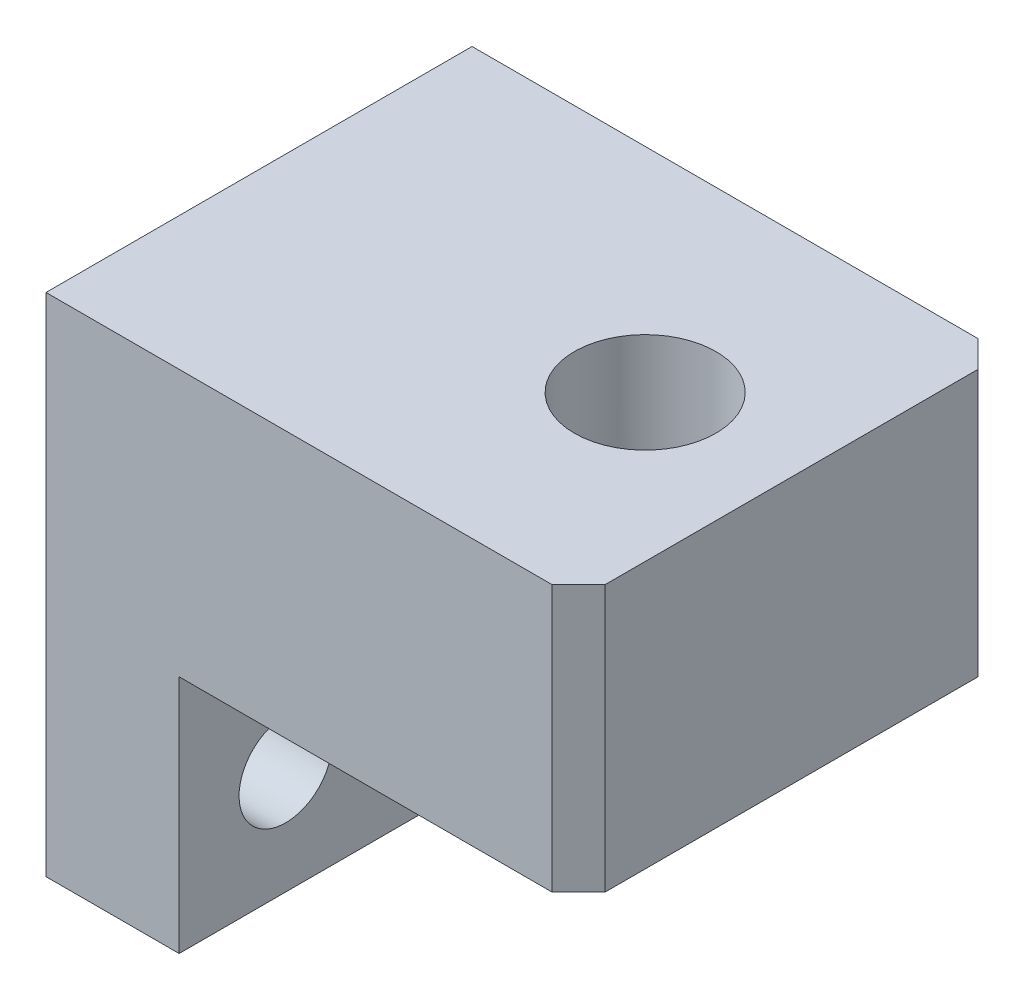
ISO-10303-21;
HEADER;
FILE_DESCRIPTION(('STEP AP214'),'2;1');
FILE_NAME('part.step','',(''),(''),'','','');
FILE_SCHEMA(('AUTOMOTIVE_DESIGN { 1 0 10303 214 1 1 1 1 }'));
ENDSEC;
DATA;
#1=APPLICATION_CONTEXT('core data for automotive mechanical design processes');
#2=APPLICATION_PROTOCOL_DEFINITION('international standard','automotive_design',2000,#1);
#3=PRODUCT_CONTEXT('',#1,'mechanical');
#4=PRODUCT('Part','Part','',(#3));
#5=PRODUCT_RELATED_PRODUCT_CATEGORY('part','',(#4));
#6=PRODUCT_DEFINITION_FORMATION('','',#4);
#7=PRODUCT_DEFINITION_CONTEXT('part definition',#1,'design');
#8=PRODUCT_DEFINITION('design','',#6,#7);
#9=PRODUCT_DEFINITION_SHAPE('','',#8);
#10=(LENGTH_UNIT() NAMED_UNIT(*) SI_UNIT(.MILLI.,.METRE.));
#11=(NAMED_UNIT(*) PLANE_ANGLE_UNIT() SI_UNIT($,.RADIAN.));
#12=(NAMED_UNIT(*) SI_UNIT($,.STERADIAN.) SOLID_ANGLE_UNIT());
#13=UNCERTAINTY_MEASURE_WITH_UNIT(LENGTH_MEASURE(1.E-05),#10,'distance_accuracy_value','');
#14=(GEOMETRIC_REPRESENTATION_CONTEXT(3) GLOBAL_UNCERTAINTY_ASSIGNED_CONTEXT((#13)) GLOBAL_UNIT_ASSIGNED_CONTEXT((#10,
#11,#12)) REPRESENTATION_CONTEXT('',''));
#15=CARTESIAN_POINT('',(0.,0.,0.));
#16=DIRECTION('',(0.,0.,1.));
#17=DIRECTION('',(1.,0.,0.));
#18=AXIS2_PLACEMENT_3D('',#15,#16,#17);
#19=CARTESIAN_POINT('',(11.4525139664804,7.85474860335195,16.));
#20=DIRECTION('',(-1.,0.,0.));
#21=DIRECTION('',(0.,-1.,0.));
#22=AXIS2_PLACEMENT_3D('',#19,#20,#21);
#23=PLANE('',#22);
#24=DIRECTION('',(0.,0.,-1.));
#25=VECTOR('',#24,1.);
#26=CARTESIAN_POINT('',(11.4525139664804,7.85474860335195,16.));
#27=LINE('',#26,#25);
#28=CARTESIAN_POINT('',(11.4525139664804,7.85474860335195,15.));
#29=VERTEX_POINT('',#28);
#30=CARTESIAN_POINT('',(11.4525139664804,7.85474860335195,0.999999999999997));
#31=VERTEX_POINT('',#30);
#32=EDGE_CURVE('E117',#29,#31,#27,.T.);
#33=ORIENTED_EDGE('',*,*,#32,.F.);
#34=DIRECTION('',(0.,-1.,0.));
#35=VECTOR('',#34,1.);
#36=CARTESIAN_POINT('',(11.4525139664804,7.85474860335195,15.));
#37=LINE('',#36,#35);
#38=CARTESIAN_POINT('',(11.4525139664805,-2.14525139664805,15.));
#39=VERTEX_POINT('',#38);
#40=EDGE_CURVE('E163',#29,#39,#37,.T.);
#41=ORIENTED_EDGE('',*,*,#40,.T.);
#42=DIRECTION('',(0.,0.,-1.));
#43=VECTOR('',#42,1.);
#44=CARTESIAN_POINT('',(11.4525139664805,-2.14525139664805,16.));
#45=LINE('',#44,#43);
#46=CARTESIAN_POINT('',(11.4525139664805,-2.14525139664805,0.999999999999997));
#47=VERTEX_POINT('',#46);
#48=EDGE_CURVE('E132',#39,#47,#45,.T.);
#49=ORIENTED_EDGE('',*,*,#48,.T.);
#50=DIRECTION('',(0.,1.,0.));
#51=VECTOR('',#50,1.);
#52=CARTESIAN_POINT('',(11.4525139664804,7.85474860335195,0.999999999999997));
#53=LINE('',#52,#51);
#54=EDGE_CURVE('E160',#47,#31,#53,.T.);
#55=ORIENTED_EDGE('',*,*,#54,.T.);
#56=EDGE_LOOP('',(#33,#41,#49,#55));
#57=FACE_BOUND('',#56,.T.);
#58=ADVANCED_FACE('F33',(#57),#23,.F.);
#59=CARTESIAN_POINT('',(-8.54748603351955,7.85474860335195,16.));
#60=DIRECTION('',(0.,-1.,0.));
#61=DIRECTION('',(0.,0.,-1.));
#62=AXIS2_PLACEMENT_3D('',#59,#60,#61);
#63=PLANE('',#62);
#64=CARTESIAN_POINT('',(5.95251396648045,7.85474860335195,8.));
#65=DIRECTION('',(0.,1.,0.));
#66=DIRECTION('',(0.,0.,1.));
#67=AXIS2_PLACEMENT_3D('',#64,#65,#66);
#68=CIRCLE('',#67,2.65803682932799);
#69=CARTESIAN_POINT('',(5.95251396648045,7.85474860335195,10.658036829328));
#70=VERTEX_POINT('',#69);
#71=EDGE_CURVE('E154',#70,#70,#68,.T.);
#72=ORIENTED_EDGE('',*,*,#71,.F.);
#73=EDGE_LOOP('',(#72));
#74=FACE_BOUND('',#73,.T.);
#75=DIRECTION('',(-1.,0.,0.));
#76=VECTOR('',#75,1.);
#77=CARTESIAN_POINT('',(-8.54748603351955,7.85474860335195,16.));
#78=LINE('',#77,#76);
#79=CARTESIAN_POINT('',(10.4525139664805,7.85474860335195,16.));
#80=VERTEX_POINT('',#79);
#81=CARTESIAN_POINT('',(-8.54748603351955,7.85474860335195,16.));
#82=VERTEX_POINT('',#81);
#83=EDGE_CURVE('E99',#80,#82,#78,.T.);
#84=ORIENTED_EDGE('',*,*,#83,.F.);
#85=DIRECTION('',(-0.707106781186545,0.,0.70710678118655));
#86=VECTOR('',#85,1.);
#87=CARTESIAN_POINT('',(10.4525139664805,7.85474860335195,16.));
#88=LINE('',#87,#86);
#89=EDGE_CURVE('E158',#80,#29,#88,.F.);
#90=ORIENTED_EDGE('',*,*,#89,.T.);
#91=ORIENTED_EDGE('',*,*,#32,.T.);
#92=DIRECTION('',(-0.70710678118655,0.,-0.707106781186545));
#93=VECTOR('',#92,1.);
#94=CARTESIAN_POINT('',(11.4525139664804,7.85474860335195,0.999999999999997));
#95=LINE('',#94,#93);
#96=CARTESIAN_POINT('',(10.4525139664804,7.85474860335195,0.));
#97=VERTEX_POINT('',#96);
#98=EDGE_CURVE('E156',#31,#97,#95,.T.);
#99=ORIENTED_EDGE('',*,*,#98,.T.);
#100=DIRECTION('',(-1.,0.,0.));
#101=VECTOR('',#100,1.);
#102=CARTESIAN_POINT('',(-8.54748603351955,7.85474860335195,0.));
#103=LINE('',#102,#101);
#104=CARTESIAN_POINT('',(-8.54748603351955,7.85474860335195,0.));
#105=VERTEX_POINT('',#104);
#106=EDGE_CURVE('E114',#97,#105,#103,.T.);
#107=ORIENTED_EDGE('',*,*,#106,.T.);
#108=DIRECTION('',(0.,0.,-1.));
#109=VECTOR('',#108,1.);
#110=CARTESIAN_POINT('',(-8.54748603351955,7.85474860335195,16.));
#111=LINE('',#110,#109);
#112=EDGE_CURVE('E112',#82,#105,#111,.T.);
#113=ORIENTED_EDGE('',*,*,#112,.F.);
#114=EDGE_LOOP('',(#84,#90,#91,#99,#107,#113));
#115=FACE_BOUND('',#114,.T.);
#116=ADVANCED_FACE('F113',(#74,#115),#63,.F.);
#117=CARTESIAN_POINT('',(-8.54748603351955,-11.145251396648,16.));
#118=DIRECTION('',(1.,0.,0.));
#119=DIRECTION('',(0.,0.,-1.));
#120=AXIS2_PLACEMENT_3D('',#117,#118,#119);
#121=PLANE('',#120);
#122=CARTESIAN_POINT('',(-8.54748603351955,-7.14525139664805,4.));
#123=DIRECTION('',(1.,0.,0.));
#124=DIRECTION('',(0.,1.,0.));
#125=AXIS2_PLACEMENT_3D('',#122,#123,#124);
#126=CIRCLE('',#125,1.75);
#127=CARTESIAN_POINT('',(-8.54748603351955,-5.39525139664805,4.));
#128=VERTEX_POINT('',#127);
#129=EDGE_CURVE('E294',#128,#128,#126,.T.);
#130=ORIENTED_EDGE('',*,*,#129,.T.);
#131=EDGE_LOOP('',(#130));
#132=FACE_BOUND('',#131,.T.);
#133=CARTESIAN_POINT('',(-8.54748603351955,-7.14525139664805,12.));
#134=DIRECTION('',(1.,0.,0.));
#135=DIRECTION('',(0.,1.,0.));
#136=AXIS2_PLACEMENT_3D('',#133,#134,#135);
#137=CIRCLE('',#136,1.75);
#138=CARTESIAN_POINT('',(-8.54748603351955,-5.39525139664805,12.));
#139=VERTEX_POINT('',#138);
#140=EDGE_CURVE('E297',#139,#139,#137,.T.);
#141=ORIENTED_EDGE('',*,*,#140,.T.);
#142=EDGE_LOOP('',(#141));
#143=FACE_BOUND('',#142,.T.);
#144=DIRECTION('',(0.,-1.,0.));
#145=VECTOR('',#144,1.);
#146=CARTESIAN_POINT('',(-8.54748603351955,-11.145251396648,0.));
#147=LINE('',#146,#145);
#148=CARTESIAN_POINT('',(-8.54748603351955,-11.145251396648,0.));
#149=VERTEX_POINT('',#148);
#150=EDGE_CURVE('E134',#105,#149,#147,.T.);
#151=ORIENTED_EDGE('',*,*,#150,.T.);
#152=DIRECTION('',(0.,0.,-1.));
#153=VECTOR('',#152,1.);
#154=CARTESIAN_POINT('',(-8.54748603351955,-11.145251396648,16.));
#155=LINE('',#154,#153);
#156=CARTESIAN_POINT('',(-8.54748603351955,-11.145251396648,16.));
#157=VERTEX_POINT('',#156);
#158=EDGE_CURVE('E118',#157,#149,#155,.T.);
#159=ORIENTED_EDGE('',*,*,#158,.F.);
#160=DIRECTION('',(0.,-1.,0.));
#161=VECTOR('',#160,1.);
#162=CARTESIAN_POINT('',(-8.54748603351955,-11.145251396648,16.));
#163=LINE('',#162,#161);
#164=EDGE_CURVE('E104',#82,#157,#163,.T.);
#165=ORIENTED_EDGE('',*,*,#164,.F.);
#166=ORIENTED_EDGE('',*,*,#112,.T.);
#167=EDGE_LOOP('',(#151,#159,#165,#166));
#168=FACE_BOUND('',#167,.T.);
#169=ADVANCED_FACE('F120',(#132,#143,#168),#121,.F.);
#170=CARTESIAN_POINT('',(-3.54748603351955,-11.145251396648,16.));
#171=DIRECTION('',(0.,1.,0.));
#172=DIRECTION('',(-1.,0.,0.));
#173=AXIS2_PLACEMENT_3D('',#170,#171,#172);
#174=PLANE('',#173);
#175=DIRECTION('',(1.,0.,0.));
#176=VECTOR('',#175,1.);
#177=CARTESIAN_POINT('',(-3.54748603351955,-11.145251396648,0.));
#178=LINE('',#177,#176);
#179=CARTESIAN_POINT('',(-3.54748603351955,-11.145251396648,0.));
#180=VERTEX_POINT('',#179);
#181=EDGE_CURVE('E137',#149,#180,#178,.T.);
#182=ORIENTED_EDGE('',*,*,#181,.T.);
#183=DIRECTION('',(0.,0.,-1.));
#184=VECTOR('',#183,1.);
#185=CARTESIAN_POINT('',(-3.54748603351955,-11.145251396648,16.));
#186=LINE('',#185,#184);
#187=CARTESIAN_POINT('',(-3.54748603351955,-11.145251396648,16.));
#188=VERTEX_POINT('',#187);
#189=EDGE_CURVE('E146',#188,#180,#186,.T.);
#190=ORIENTED_EDGE('',*,*,#189,.F.);
#191=DIRECTION('',(1.,0.,0.));
#192=VECTOR('',#191,1.);
#193=CARTESIAN_POINT('',(-3.54748603351955,-11.145251396648,16.));
#194=LINE('',#193,#192);
#195=EDGE_CURVE('E123',#157,#188,#194,.T.);
#196=ORIENTED_EDGE('',*,*,#195,.F.);
#197=ORIENTED_EDGE('',*,*,#158,.T.);
#198=EDGE_LOOP('',(#182,#190,#196,#197));
#199=FACE_BOUND('',#198,.T.);
#200=ADVANCED_FACE('F181',(#199),#174,.F.);
#201=CARTESIAN_POINT('',(-3.54748603351955,-2.14525139664805,16.));
#202=DIRECTION('',(-1.,0.,0.));
#203=DIRECTION('',(0.,-1.,0.));
#204=AXIS2_PLACEMENT_3D('',#201,#202,#203);
#205=PLANE('',#204);
#206=CARTESIAN_POINT('',(-3.54748603351955,-7.14525139664805,4.));
#207=DIRECTION('',(1.,0.,0.));
#208=DIRECTION('',(0.,1.,0.));
#209=AXIS2_PLACEMENT_3D('',#206,#207,#208);
#210=CIRCLE('',#209,1.75);
#211=CARTESIAN_POINT('',(-3.54748603351955,-5.39525139664805,4.));
#212=VERTEX_POINT('',#211);
#213=EDGE_CURVE('E304',#212,#212,#210,.T.);
#214=ORIENTED_EDGE('',*,*,#213,.F.);
#215=EDGE_LOOP('',(#214));
#216=FACE_BOUND('',#215,.T.);
#217=CARTESIAN_POINT('',(-3.54748603351955,-7.14525139664805,12.));
#218=DIRECTION('',(1.,0.,0.));
#219=DIRECTION('',(0.,1.,0.));
#220=AXIS2_PLACEMENT_3D('',#217,#218,#219);
#221=CIRCLE('',#220,1.75);
#222=CARTESIAN_POINT('',(-3.54748603351955,-5.39525139664805,12.));
#223=VERTEX_POINT('',#222);
#224=EDGE_CURVE('E298',#223,#223,#221,.T.);
#225=ORIENTED_EDGE('',*,*,#224,.F.);
#226=EDGE_LOOP('',(#225));
#227=FACE_BOUND('',#226,.T.);
#228=DIRECTION('',(0.,1.,0.));
#229=VECTOR('',#228,1.);
#230=CARTESIAN_POINT('',(-3.54748603351955,-2.14525139664805,0.));
#231=LINE('',#230,#229);
#232=CARTESIAN_POINT('',(-3.54748603351955,-2.14525139664805,0.));
#233=VERTEX_POINT('',#232);
#234=EDGE_CURVE('E139',#180,#233,#231,.T.);
#235=ORIENTED_EDGE('',*,*,#234,.T.);
#236=DIRECTION('',(0.,0.,-1.));
#237=VECTOR('',#236,1.);
#238=CARTESIAN_POINT('',(-3.54748603351955,-2.14525139664805,16.));
#239=LINE('',#238,#237);
#240=CARTESIAN_POINT('',(-3.54748603351955,-2.14525139664805,16.));
#241=VERTEX_POINT('',#240);
#242=EDGE_CURVE('E143',#241,#233,#239,.T.);
#243=ORIENTED_EDGE('',*,*,#242,.F.);
#244=DIRECTION('',(0.,1.,0.));
#245=VECTOR('',#244,1.);
#246=CARTESIAN_POINT('',(-3.54748603351955,-2.14525139664805,16.));
#247=LINE('',#246,#245);
#248=EDGE_CURVE('E125',#188,#241,#247,.T.);
#249=ORIENTED_EDGE('',*,*,#248,.F.);
#250=ORIENTED_EDGE('',*,*,#189,.T.);
#251=EDGE_LOOP('',(#235,#243,#249,#250));
#252=FACE_BOUND('',#251,.T.);
#253=ADVANCED_FACE('F184',(#216,#227,#252),#205,.F.);
#254=CARTESIAN_POINT('',(11.4525139664805,-2.14525139664805,16.));
#255=DIRECTION('',(0.,1.,0.));
#256=DIRECTION('',(-1.,0.,0.));
#257=AXIS2_PLACEMENT_3D('',#254,#255,#256);
#258=PLANE('',#257);
#259=CARTESIAN_POINT('',(5.95251396648045,-2.14525139664805,8.));
#260=DIRECTION('',(0.,1.,0.));
#261=DIRECTION('',(-1.,0.,0.));
#262=AXIS2_PLACEMENT_3D('',#259,#260,#261);
#263=CIRCLE('',#262,2.65803682932799);
#264=CARTESIAN_POINT('',(3.29447713715246,-2.14525139664805,8.));
#265=VERTEX_POINT('',#264);
#266=EDGE_CURVE('E135',#265,#265,#263,.T.);
#267=ORIENTED_EDGE('',*,*,#266,.T.);
#268=EDGE_LOOP('',(#267));
#269=FACE_BOUND('',#268,.T.);
#270=ORIENTED_EDGE('',*,*,#48,.F.);
#271=DIRECTION('',(0.707106781186545,0.,-0.70710678118655));
#272=VECTOR('',#271,1.);
#273=CARTESIAN_POINT('',(10.4525139664805,-2.14525139664805,16.));
#274=LINE('',#273,#272);
#275=CARTESIAN_POINT('',(10.4525139664805,-2.14525139664805,16.));
#276=VERTEX_POINT('',#275);
#277=EDGE_CURVE('E41',#39,#276,#274,.F.);
#278=ORIENTED_EDGE('',*,*,#277,.T.);
#279=DIRECTION('',(1.,0.,0.));
#280=VECTOR('',#279,1.);
#281=CARTESIAN_POINT('',(11.4525139664805,-2.14525139664805,16.));
#282=LINE('',#281,#280);
#283=EDGE_CURVE('E130',#241,#276,#282,.T.);
#284=ORIENTED_EDGE('',*,*,#283,.F.);
#285=ORIENTED_EDGE('',*,*,#242,.T.);
#286=DIRECTION('',(1.,0.,0.));
#287=VECTOR('',#286,1.);
#288=CARTESIAN_POINT('',(11.4525139664805,-2.14525139664805,0.));
#289=LINE('',#288,#287);
#290=CARTESIAN_POINT('',(10.4525139664804,-2.14525139664805,0.));
#291=VERTEX_POINT('',#290);
#292=EDGE_CURVE('E109',#233,#291,#289,.T.);
#293=ORIENTED_EDGE('',*,*,#292,.T.);
#294=DIRECTION('',(0.70710678118655,0.,0.707106781186545));
#295=VECTOR('',#294,1.);
#296=CARTESIAN_POINT('',(11.4525139664805,-2.14525139664805,0.999999999999996));
#297=LINE('',#296,#295);
#298=EDGE_CURVE('E53',#291,#47,#297,.T.);
#299=ORIENTED_EDGE('',*,*,#298,.T.);
#300=EDGE_LOOP('',(#270,#278,#284,#285,#293,#299));
#301=FACE_BOUND('',#300,.T.);
#302=ADVANCED_FACE('F167',(#269,#301),#258,.F.);
#303=CARTESIAN_POINT('',(0.,0.,16.));
#304=DIRECTION('',(0.,0.,-1.));
#305=DIRECTION('',(-1.,0.,0.));
#306=AXIS2_PLACEMENT_3D('',#303,#304,#305);
#307=PLANE('',#306);
#308=ORIENTED_EDGE('',*,*,#283,.T.);
#309=DIRECTION('',(0.,1.,0.));
#310=VECTOR('',#309,1.);
#311=CARTESIAN_POINT('',(10.4525139664805,0.,16.));
#312=LINE('',#311,#310);
#313=EDGE_CURVE('E107',#276,#80,#312,.T.);
#314=ORIENTED_EDGE('',*,*,#313,.T.);
#315=ORIENTED_EDGE('',*,*,#83,.T.);
#316=ORIENTED_EDGE('',*,*,#164,.T.);
#317=ORIENTED_EDGE('',*,*,#195,.T.);
#318=ORIENTED_EDGE('',*,*,#248,.T.);
#319=EDGE_LOOP('',(#308,#314,#315,#316,#317,#318));
#320=FACE_BOUND('',#319,.T.);
#321=ADVANCED_FACE('F102',(#320),#307,.F.);
#322=CARTESIAN_POINT('',(0.,0.,0.));
#323=DIRECTION('',(0.,0.,-1.));
#324=DIRECTION('',(-1.,0.,0.));
#325=AXIS2_PLACEMENT_3D('',#322,#323,#324);
#326=PLANE('',#325);
#327=ORIENTED_EDGE('',*,*,#106,.F.);
#328=DIRECTION('',(0.,-1.,0.));
#329=VECTOR('',#328,1.);
#330=CARTESIAN_POINT('',(10.4525139664804,-2.14525139664805,0.));
#331=LINE('',#330,#329);
#332=EDGE_CURVE('E11',#97,#291,#331,.T.);
#333=ORIENTED_EDGE('',*,*,#332,.T.);
#334=ORIENTED_EDGE('',*,*,#292,.F.);
#335=ORIENTED_EDGE('',*,*,#234,.F.);
#336=ORIENTED_EDGE('',*,*,#181,.F.);
#337=ORIENTED_EDGE('',*,*,#150,.F.);
#338=EDGE_LOOP('',(#327,#333,#334,#335,#336,#337));
#339=FACE_BOUND('',#338,.T.);
#340=ADVANCED_FACE('F177',(#339),#326,.T.);
#341=CARTESIAN_POINT('',(5.95251396648045,-8.14525139664805,8.));
#342=DIRECTION('',(0.,1.,0.));
#343=DIRECTION('',(0.,0.,1.));
#344=AXIS2_PLACEMENT_3D('',#341,#342,#343);
#345=CYLINDRICAL_SURFACE('',#344,2.65803682932799);
#346=ORIENTED_EDGE('',*,*,#71,.T.);
#347=EDGE_LOOP('',(#346));
#348=FACE_BOUND('',#347,.T.);
#349=ORIENTED_EDGE('',*,*,#266,.F.);
#350=EDGE_LOOP('',(#349));
#351=FACE_BOUND('',#350,.T.);
#352=ADVANCED_FACE('F217',(#348,#351),#345,.F.);
#353=CARTESIAN_POINT('',(-8.54748603351955,-7.14525139664805,12.));
#354=DIRECTION('',(1.,0.,0.));
#355=DIRECTION('',(0.,1.,0.));
#356=AXIS2_PLACEMENT_3D('',#353,#354,#355);
#357=CYLINDRICAL_SURFACE('',#356,1.75);
#358=ORIENTED_EDGE('',*,*,#140,.F.);
#359=EDGE_LOOP('',(#358));
#360=FACE_BOUND('',#359,.T.);
#361=ORIENTED_EDGE('',*,*,#224,.T.);
#362=EDGE_LOOP('',(#361));
#363=FACE_BOUND('',#362,.T.);
#364=ADVANCED_FACE('F211',(#360,#363),#357,.F.);
#365=CARTESIAN_POINT('',(-8.54748603351955,-7.14525139664805,4.));
#366=DIRECTION('',(1.,0.,0.));
#367=DIRECTION('',(0.,1.,0.));
#368=AXIS2_PLACEMENT_3D('',#365,#366,#367);
#369=CYLINDRICAL_SURFACE('',#368,1.75);
#370=ORIENTED_EDGE('',*,*,#129,.F.);
#371=EDGE_LOOP('',(#370));
#372=FACE_BOUND('',#371,.T.);
#373=ORIENTED_EDGE('',*,*,#213,.T.);
#374=EDGE_LOOP('',(#373));
#375=FACE_BOUND('',#374,.T.);
#376=ADVANCED_FACE('F206',(#372,#375),#369,.F.);
#377=CARTESIAN_POINT('',(10.4525139664805,0.,16.));
#378=DIRECTION('',(-0.70710678118655,0.,-0.707106781186545));
#379=DIRECTION('',(0.,1.,0.));
#380=AXIS2_PLACEMENT_3D('',#377,#378,#379);
#381=PLANE('',#380);
#382=ORIENTED_EDGE('',*,*,#277,.F.);
#383=ORIENTED_EDGE('',*,*,#40,.F.);
#384=ORIENTED_EDGE('',*,*,#89,.F.);
#385=ORIENTED_EDGE('',*,*,#313,.F.);
#386=EDGE_LOOP('',(#382,#383,#384,#385));
#387=FACE_BOUND('',#386,.T.);
#388=ADVANCED_FACE('F172',(#387),#381,.F.);
#389=CARTESIAN_POINT('',(11.4525139664804,7.85474860335195,0.999999999999997));
#390=DIRECTION('',(0.707106781186545,0.,-0.70710678118655));
#391=DIRECTION('',(0.,-1.,0.));
#392=AXIS2_PLACEMENT_3D('',#389,#390,#391);
#393=PLANE('',#392);
#394=ORIENTED_EDGE('',*,*,#298,.F.);
#395=ORIENTED_EDGE('',*,*,#332,.F.);
#396=ORIENTED_EDGE('',*,*,#98,.F.);
#397=ORIENTED_EDGE('',*,*,#54,.F.);
#398=EDGE_LOOP('',(#394,#395,#396,#397));
#399=FACE_BOUND('',#398,.T.);
#400=ADVANCED_FACE('F35',(#399),#393,.T.);
#401=CLOSED_SHELL('',(#58,#116,#169,#200,#253,#302,#321,#340,#352,#364,#376,#388,#400));
#402=MANIFOLD_SOLID_BREP('B2',#401);
#403=ADVANCED_BREP_SHAPE_REPRESENTATION('',(#18,#402),#14);
#404=SHAPE_DEFINITION_REPRESENTATION(#9,#403);
ENDSEC;
END-ISO-10303-21;
